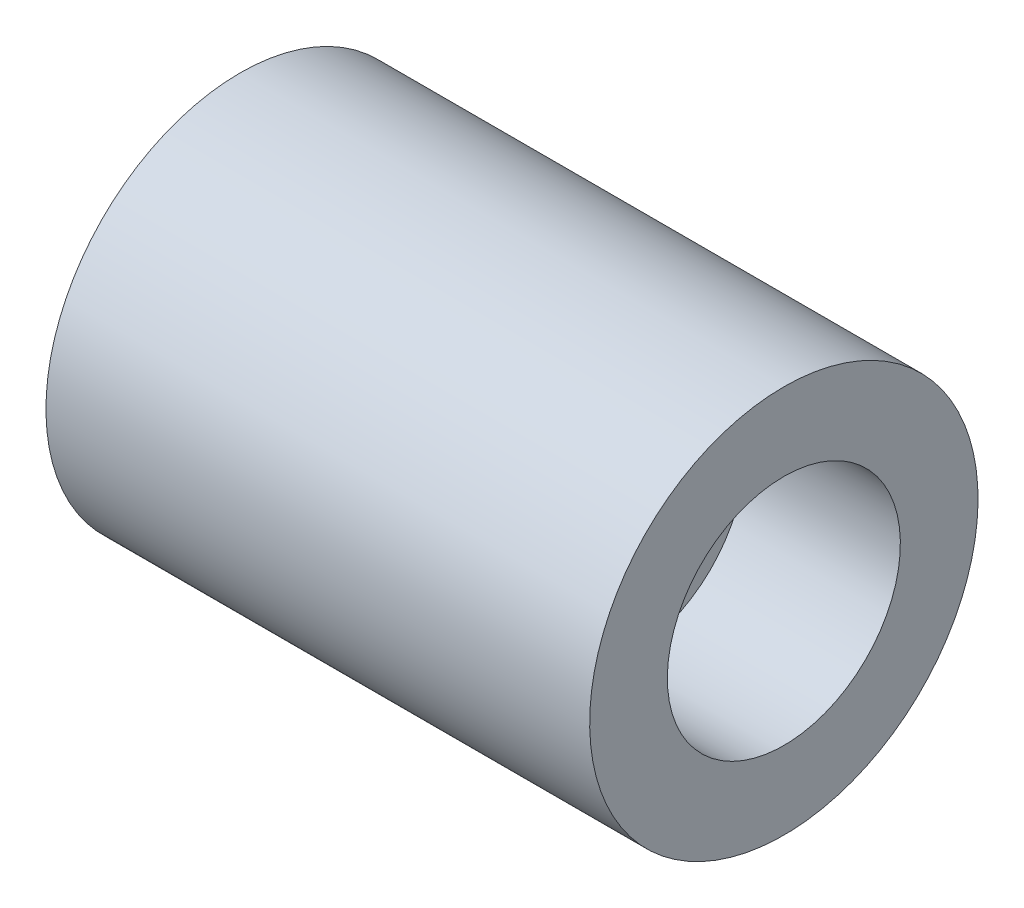
ISO-10303-21;
HEADER;
FILE_DESCRIPTION(('STEP AP214'),'2;1');
FILE_NAME('part.step','',(''),(''),'','','');
FILE_SCHEMA(('AUTOMOTIVE_DESIGN { 1 0 10303 214 1 1 1 1 }'));
ENDSEC;
DATA;
#1=APPLICATION_CONTEXT('core data for automotive mechanical design processes');
#2=APPLICATION_PROTOCOL_DEFINITION('international standard','automotive_design',2000,#1);
#3=PRODUCT_CONTEXT('',#1,'mechanical');
#4=PRODUCT('Part','Part','',(#3));
#5=PRODUCT_RELATED_PRODUCT_CATEGORY('part','',(#4));
#6=PRODUCT_DEFINITION_FORMATION('','',#4);
#7=PRODUCT_DEFINITION_CONTEXT('part definition',#1,'design');
#8=PRODUCT_DEFINITION('design','',#6,#7);
#9=PRODUCT_DEFINITION_SHAPE('','',#8);
#10=(LENGTH_UNIT() NAMED_UNIT(*) SI_UNIT(.MILLI.,.METRE.));
#11=(NAMED_UNIT(*) PLANE_ANGLE_UNIT() SI_UNIT($,.RADIAN.));
#12=(NAMED_UNIT(*) SI_UNIT($,.STERADIAN.) SOLID_ANGLE_UNIT());
#13=UNCERTAINTY_MEASURE_WITH_UNIT(LENGTH_MEASURE(1.E-05),#10,'distance_accuracy_value','');
#14=(GEOMETRIC_REPRESENTATION_CONTEXT(3) GLOBAL_UNCERTAINTY_ASSIGNED_CONTEXT((#13)) GLOBAL_UNIT_ASSIGNED_CONTEXT((#10,
#11,#12)) REPRESENTATION_CONTEXT('',''));
#15=CARTESIAN_POINT('',(0.,0.,0.));
#16=DIRECTION('',(0.,0.,1.));
#17=DIRECTION('',(1.,0.,0.));
#18=AXIS2_PLACEMENT_3D('',#15,#16,#17);
#19=CARTESIAN_POINT('',(20.,-50.,0.));
#20=DIRECTION('',(1.,0.,0.));
#21=DIRECTION('',(0.,1.,0.));
#22=AXIS2_PLACEMENT_3D('',#19,#20,#21);
#23=CYLINDRICAL_SURFACE('',#22,50.);
#24=CARTESIAN_POINT('',(140.,-50.,0.));
#25=DIRECTION('',(1.,0.,0.));
#26=DIRECTION('',(0.,1.,0.));
#27=AXIS2_PLACEMENT_3D('',#24,#25,#26);
#28=CIRCLE('',#27,50.);
#29=CARTESIAN_POINT('',(140.,0.,0.));
#30=VERTEX_POINT('',#29);
#31=EDGE_CURVE('E65',#30,#30,#28,.T.);
#32=ORIENTED_EDGE('',*,*,#31,.F.);
#33=EDGE_LOOP('',(#32));
#34=FACE_BOUND('',#33,.T.);
#35=CARTESIAN_POINT('',(0.,-50.,0.));
#36=DIRECTION('',(1.,0.,0.));
#37=DIRECTION('',(0.,1.,0.));
#38=AXIS2_PLACEMENT_3D('',#35,#36,#37);
#39=CIRCLE('',#38,50.);
#40=CARTESIAN_POINT('',(0.,0.,0.));
#41=VERTEX_POINT('',#40);
#42=EDGE_CURVE('E69',#41,#41,#39,.T.);
#43=ORIENTED_EDGE('',*,*,#42,.T.);
#44=EDGE_LOOP('',(#43));
#45=FACE_BOUND('',#44,.T.);
#46=ADVANCED_FACE('F41',(#34,#45),#23,.T.);
#47=CARTESIAN_POINT('',(140.,0.,0.));
#48=DIRECTION('',(-1.,0.,0.));
#49=DIRECTION('',(0.,-1.,0.));
#50=AXIS2_PLACEMENT_3D('',#47,#48,#49);
#51=PLANE('',#50);
#52=CARTESIAN_POINT('',(140.,-50.,0.));
#53=DIRECTION('',(1.,0.,0.));
#54=DIRECTION('',(0.,1.,0.));
#55=AXIS2_PLACEMENT_3D('',#52,#53,#54);
#56=CIRCLE('',#55,30.);
#57=CARTESIAN_POINT('',(140.,-20.,0.));
#58=VERTEX_POINT('',#57);
#59=EDGE_CURVE('E59',#58,#58,#56,.T.);
#60=ORIENTED_EDGE('',*,*,#59,.F.);
#61=EDGE_LOOP('',(#60));
#62=FACE_BOUND('',#61,.T.);
#63=ORIENTED_EDGE('',*,*,#31,.T.);
#64=EDGE_LOOP('',(#63));
#65=FACE_BOUND('',#64,.T.);
#66=ADVANCED_FACE('F77',(#62,#65),#51,.F.);
#67=CARTESIAN_POINT('',(0.,0.,0.));
#68=DIRECTION('',(1.,0.,0.));
#69=DIRECTION('',(0.,1.,0.));
#70=AXIS2_PLACEMENT_3D('',#67,#68,#69);
#71=PLANE('',#70);
#72=ORIENTED_EDGE('',*,*,#42,.F.);
#73=EDGE_LOOP('',(#72));
#74=FACE_BOUND('',#73,.T.);
#75=ADVANCED_FACE('F43',(#74),#71,.F.);
#76=CARTESIAN_POINT('',(20.,-50.,0.));
#77=DIRECTION('',(1.,0.,0.));
#78=DIRECTION('',(0.,1.,0.));
#79=AXIS2_PLACEMENT_3D('',#76,#77,#78);
#80=CYLINDRICAL_SURFACE('',#79,30.);
#81=CARTESIAN_POINT('',(100.,-50.,0.));
#82=DIRECTION('',(1.,0.,0.));
#83=DIRECTION('',(0.,1.,0.));
#84=AXIS2_PLACEMENT_3D('',#81,#82,#83);
#85=CIRCLE('',#84,30.);
#86=CARTESIAN_POINT('',(100.,-20.,0.));
#87=VERTEX_POINT('',#86);
#88=EDGE_CURVE('E54',#87,#87,#85,.T.);
#89=ORIENTED_EDGE('',*,*,#88,.F.);
#90=EDGE_LOOP('',(#89));
#91=FACE_BOUND('',#90,.T.);
#92=ORIENTED_EDGE('',*,*,#59,.T.);
#93=EDGE_LOOP('',(#92));
#94=FACE_BOUND('',#93,.T.);
#95=ADVANCED_FACE('F76',(#91,#94),#80,.F.);
#96=CARTESIAN_POINT('',(100.,0.,0.));
#97=DIRECTION('',(-1.,0.,0.));
#98=DIRECTION('',(0.,-1.,0.));
#99=AXIS2_PLACEMENT_3D('',#96,#97,#98);
#100=PLANE('',#99);
#101=CARTESIAN_POINT('',(100.,-50.,0.));
#102=DIRECTION('',(1.,0.,0.));
#103=DIRECTION('',(0.,1.,0.));
#104=AXIS2_PLACEMENT_3D('',#101,#102,#103);
#105=CIRCLE('',#104,9.99999999999997);
#106=CARTESIAN_POINT('',(100.,-40.,0.));
#107=VERTEX_POINT('',#106);
#108=EDGE_CURVE('E49',#107,#107,#105,.T.);
#109=ORIENTED_EDGE('',*,*,#108,.F.);
#110=EDGE_LOOP('',(#109));
#111=FACE_BOUND('',#110,.T.);
#112=ORIENTED_EDGE('',*,*,#88,.T.);
#113=EDGE_LOOP('',(#112));
#114=FACE_BOUND('',#113,.T.);
#115=ADVANCED_FACE('F82',(#111,#114),#100,.F.);
#116=CARTESIAN_POINT('',(20.,-50.,0.));
#117=DIRECTION('',(1.,0.,0.));
#118=DIRECTION('',(0.,1.,0.));
#119=AXIS2_PLACEMENT_3D('',#116,#117,#118);
#120=CYLINDRICAL_SURFACE('',#119,9.99999999999999);
#121=CARTESIAN_POINT('',(20.,-50.,0.));
#122=DIRECTION('',(1.,0.,0.));
#123=DIRECTION('',(0.,1.,0.));
#124=AXIS2_PLACEMENT_3D('',#121,#122,#123);
#125=CIRCLE('',#124,10.);
#126=CARTESIAN_POINT('',(20.,-40.,0.));
#127=VERTEX_POINT('',#126);
#128=EDGE_CURVE('E10',#127,#127,#125,.T.);
#129=ORIENTED_EDGE('',*,*,#128,.F.);
#130=EDGE_LOOP('',(#129));
#131=FACE_BOUND('',#130,.T.);
#132=ORIENTED_EDGE('',*,*,#108,.T.);
#133=EDGE_LOOP('',(#132));
#134=FACE_BOUND('',#133,.T.);
#135=ADVANCED_FACE('F96',(#131,#134),#120,.F.);
#136=CARTESIAN_POINT('',(20.,0.,0.));
#137=DIRECTION('',(-1.,0.,0.));
#138=DIRECTION('',(0.,-1.,0.));
#139=AXIS2_PLACEMENT_3D('',#136,#137,#138);
#140=PLANE('',#139);
#141=ORIENTED_EDGE('',*,*,#128,.T.);
#142=EDGE_LOOP('',(#141));
#143=FACE_BOUND('',#142,.T.);
#144=ADVANCED_FACE('F99',(#143),#140,.F.);
#145=CLOSED_SHELL('',(#46,#66,#75,#95,#115,#135,#144));
#146=MANIFOLD_SOLID_BREP('B2',#145);
#147=ADVANCED_BREP_SHAPE_REPRESENTATION('',(#18,#146),#14);
#148=SHAPE_DEFINITION_REPRESENTATION(#9,#147);
ENDSEC;
END-ISO-10303-21;
